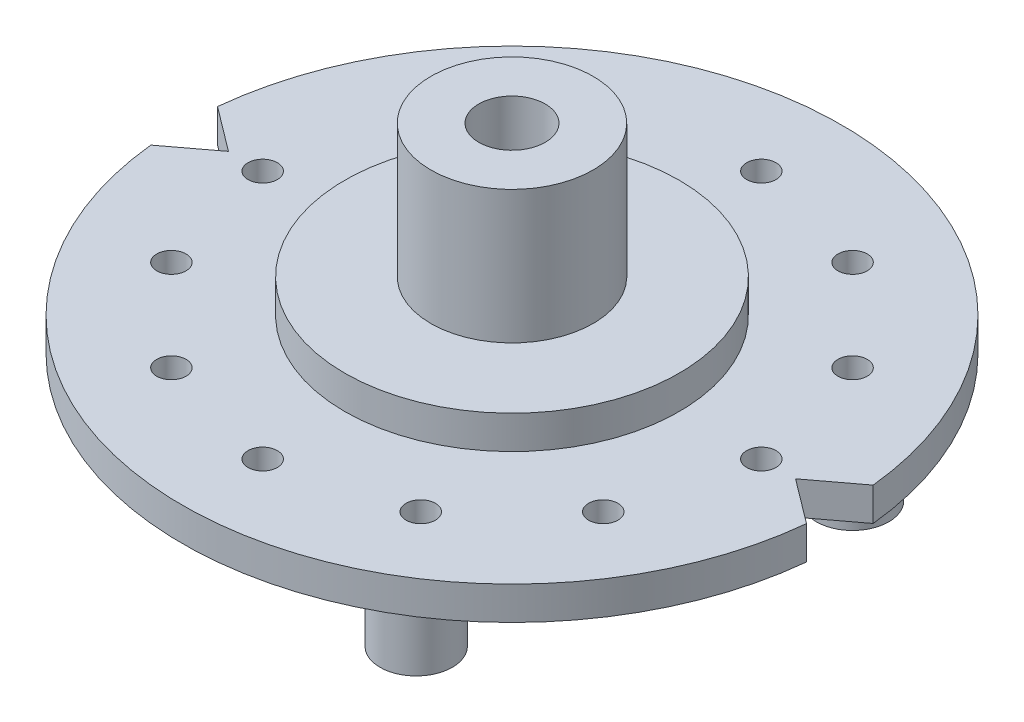
ISO-10303-21;
HEADER;
FILE_DESCRIPTION(('STEP AP214'),'2;1');
FILE_NAME('part.step','',(''),(''),'','','');
FILE_SCHEMA(('AUTOMOTIVE_DESIGN { 1 0 10303 214 1 1 1 1 }'));
ENDSEC;
DATA;
#1=APPLICATION_CONTEXT('core data for automotive mechanical design processes');
#2=APPLICATION_PROTOCOL_DEFINITION('international standard','automotive_design',2000,#1);
#3=PRODUCT_CONTEXT('',#1,'mechanical');
#4=PRODUCT('Part','Part','',(#3));
#5=PRODUCT_RELATED_PRODUCT_CATEGORY('part','',(#4));
#6=PRODUCT_DEFINITION_FORMATION('','',#4);
#7=PRODUCT_DEFINITION_CONTEXT('part definition',#1,'design');
#8=PRODUCT_DEFINITION('design','',#6,#7);
#9=PRODUCT_DEFINITION_SHAPE('','',#8);
#10=(LENGTH_UNIT() NAMED_UNIT(*) SI_UNIT(.MILLI.,.METRE.));
#11=(NAMED_UNIT(*) PLANE_ANGLE_UNIT() SI_UNIT($,.RADIAN.));
#12=(NAMED_UNIT(*) SI_UNIT($,.STERADIAN.) SOLID_ANGLE_UNIT());
#13=UNCERTAINTY_MEASURE_WITH_UNIT(LENGTH_MEASURE(1.E-05),#10,'distance_accuracy_value','');
#14=(GEOMETRIC_REPRESENTATION_CONTEXT(3) GLOBAL_UNCERTAINTY_ASSIGNED_CONTEXT((#13)) GLOBAL_UNIT_ASSIGNED_CONTEXT((#10,
#11,#12)) REPRESENTATION_CONTEXT('',''));
#15=CARTESIAN_POINT('',(0.,0.,0.));
#16=DIRECTION('',(0.,0.,1.));
#17=DIRECTION('',(1.,0.,0.));
#18=AXIS2_PLACEMENT_3D('',#15,#16,#17);
#19=CARTESIAN_POINT('',(-13.33913809263,4.318,-17.7016341307042));
#20=DIRECTION('',(0.601815023152049,0.,0.798635510047292));
#21=DIRECTION('',(0.798635510047292,0.,-0.601815023152049));
#22=AXIS2_PLACEMENT_3D('',#19,#20,#21);
#23=PLANE('',#22);
#24=DIRECTION('',(-0.798635510047292,0.,0.601815023152049));
#25=VECTOR('',#24,1.);
#26=CARTESIAN_POINT('',(-13.33913809263,0.,-17.7016341307042));
#27=LINE('',#26,#25);
#28=CARTESIAN_POINT('',(-36.83,0.,0.));
#29=VERTEX_POINT('',#28);
#30=CARTESIAN_POINT('',(-42.5791674941471,0.,4.33230844993388));
#31=VERTEX_POINT('',#30);
#32=EDGE_CURVE('E162',#29,#31,#27,.T.);
#33=ORIENTED_EDGE('',*,*,#32,.T.);
#34=DIRECTION('',(0.,-1.,0.));
#35=VECTOR('',#34,1.);
#36=CARTESIAN_POINT('',(-42.5791674941471,4.318,4.33230844993388));
#37=LINE('',#36,#35);
#38=CARTESIAN_POINT('',(-42.5791674941471,4.318,4.33230844993388));
#39=VERTEX_POINT('',#38);
#40=EDGE_CURVE('E182',#39,#31,#37,.T.);
#41=ORIENTED_EDGE('',*,*,#40,.F.);
#42=DIRECTION('',(-0.798635510047292,0.,0.601815023152049));
#43=VECTOR('',#42,1.);
#44=CARTESIAN_POINT('',(-13.33913809263,4.318,-17.7016341307042));
#45=LINE('',#44,#43);
#46=CARTESIAN_POINT('',(-36.83,4.318,0.));
#47=VERTEX_POINT('',#46);
#48=EDGE_CURVE('E382',#47,#39,#45,.T.);
#49=ORIENTED_EDGE('',*,*,#48,.F.);
#50=DIRECTION('',(0.,-1.,0.));
#51=VECTOR('',#50,1.);
#52=CARTESIAN_POINT('',(-36.83,4.318,0.));
#53=LINE('',#52,#51);
#54=EDGE_CURVE('E56',#47,#29,#53,.T.);
#55=ORIENTED_EDGE('',*,*,#54,.T.);
#56=EDGE_LOOP('',(#33,#41,#49,#55));
#57=FACE_BOUND('',#56,.T.);
#58=ADVANCED_FACE('F39',(#57),#23,.F.);
#59=CARTESIAN_POINT('',(0.,4.318,0.));
#60=DIRECTION('',(0.,-1.,0.));
#61=DIRECTION('',(0.,0.,-1.));
#62=AXIS2_PLACEMENT_3D('',#59,#60,#61);
#63=CYLINDRICAL_SURFACE('',#62,42.799);
#64=CARTESIAN_POINT('',(0.,0.,0.));
#65=DIRECTION('',(0.,1.,0.));
#66=DIRECTION('',(0.,0.,1.));
#67=AXIS2_PLACEMENT_3D('',#64,#65,#66);
#68=CIRCLE('',#67,42.799);
#69=CARTESIAN_POINT('',(42.5791674941471,0.,4.33230844993388));
#70=VERTEX_POINT('',#69);
#71=EDGE_CURVE('E164',#31,#70,#68,.T.);
#72=ORIENTED_EDGE('',*,*,#71,.T.);
#73=DIRECTION('',(0.,-1.,0.));
#74=VECTOR('',#73,1.);
#75=CARTESIAN_POINT('',(42.5791674941471,4.318,4.33230844993388));
#76=LINE('',#75,#74);
#77=CARTESIAN_POINT('',(42.5791674941471,4.318,4.33230844993388));
#78=VERTEX_POINT('',#77);
#79=EDGE_CURVE('E180',#78,#70,#76,.T.);
#80=ORIENTED_EDGE('',*,*,#79,.F.);
#81=CARTESIAN_POINT('',(0.,4.318,0.));
#82=DIRECTION('',(0.,1.,0.));
#83=DIRECTION('',(0.,0.,1.));
#84=AXIS2_PLACEMENT_3D('',#81,#82,#83);
#85=CIRCLE('',#84,42.799);
#86=EDGE_CURVE('E90',#39,#78,#85,.T.);
#87=ORIENTED_EDGE('',*,*,#86,.F.);
#88=ORIENTED_EDGE('',*,*,#40,.T.);
#89=EDGE_LOOP('',(#72,#80,#87,#88));
#90=FACE_BOUND('',#89,.T.);
#91=ADVANCED_FACE('F234',(#90),#63,.T.);
#92=CARTESIAN_POINT('',(13.33913809263,4.318,-17.7016341307042));
#93=DIRECTION('',(0.601815023152049,0.,-0.798635510047292));
#94=DIRECTION('',(-0.798635510047292,0.,-0.601815023152049));
#95=AXIS2_PLACEMENT_3D('',#92,#93,#94);
#96=PLANE('',#95);
#97=DIRECTION('',(0.798635510047292,0.,0.601815023152049));
#98=VECTOR('',#97,1.);
#99=CARTESIAN_POINT('',(13.33913809263,0.,-17.7016341307042));
#100=LINE('',#99,#98);
#101=CARTESIAN_POINT('',(36.83,0.,0.));
#102=VERTEX_POINT('',#101);
#103=EDGE_CURVE('E167',#102,#70,#100,.T.);
#104=ORIENTED_EDGE('',*,*,#103,.F.);
#105=DIRECTION('',(0.,-1.,0.));
#106=VECTOR('',#105,1.);
#107=CARTESIAN_POINT('',(36.83,4.318,0.));
#108=LINE('',#107,#106);
#109=CARTESIAN_POINT('',(36.83,4.318,0.));
#110=VERTEX_POINT('',#109);
#111=EDGE_CURVE('E117',#110,#102,#108,.T.);
#112=ORIENTED_EDGE('',*,*,#111,.F.);
#113=DIRECTION('',(0.798635510047292,0.,0.601815023152049));
#114=VECTOR('',#113,1.);
#115=CARTESIAN_POINT('',(13.33913809263,4.318,-17.7016341307042));
#116=LINE('',#115,#114);
#117=EDGE_CURVE('E107',#110,#78,#116,.T.);
#118=ORIENTED_EDGE('',*,*,#117,.T.);
#119=ORIENTED_EDGE('',*,*,#79,.T.);
#120=EDGE_LOOP('',(#104,#112,#118,#119));
#121=FACE_BOUND('',#120,.T.);
#122=ADVANCED_FACE('F239',(#121),#96,.T.);
#123=CARTESIAN_POINT('',(13.33913809263,4.318,17.7016341307042));
#124=DIRECTION('',(-0.601815023152049,0.,-0.798635510047292));
#125=DIRECTION('',(-0.798635510047292,0.,0.601815023152049));
#126=AXIS2_PLACEMENT_3D('',#123,#124,#125);
#127=PLANE('',#126);
#128=DIRECTION('',(0.798635510047292,0.,-0.601815023152049));
#129=VECTOR('',#128,1.);
#130=CARTESIAN_POINT('',(13.33913809263,0.,17.7016341307042));
#131=LINE('',#130,#129);
#132=CARTESIAN_POINT('',(42.5791674941471,0.,-4.33230844993388));
#133=VERTEX_POINT('',#132);
#134=EDGE_CURVE('E114',#102,#133,#131,.T.);
#135=ORIENTED_EDGE('',*,*,#134,.T.);
#136=DIRECTION('',(0.,-1.,0.));
#137=VECTOR('',#136,1.);
#138=CARTESIAN_POINT('',(42.5791674941471,4.318,-4.33230844993388));
#139=LINE('',#138,#137);
#140=CARTESIAN_POINT('',(42.5791674941471,4.318,-4.33230844993388));
#141=VERTEX_POINT('',#140);
#142=EDGE_CURVE('E111',#141,#133,#139,.T.);
#143=ORIENTED_EDGE('',*,*,#142,.F.);
#144=DIRECTION('',(0.798635510047292,0.,-0.601815023152049));
#145=VECTOR('',#144,1.);
#146=CARTESIAN_POINT('',(13.33913809263,4.318,17.7016341307042));
#147=LINE('',#146,#145);
#148=EDGE_CURVE('E100',#110,#141,#147,.T.);
#149=ORIENTED_EDGE('',*,*,#148,.F.);
#150=ORIENTED_EDGE('',*,*,#111,.T.);
#151=EDGE_LOOP('',(#135,#143,#149,#150));
#152=FACE_BOUND('',#151,.T.);
#153=ADVANCED_FACE('F112',(#152),#127,.F.);
#154=CARTESIAN_POINT('',(0.,4.318,0.));
#155=DIRECTION('',(0.,-1.,0.));
#156=DIRECTION('',(0.,0.,-1.));
#157=AXIS2_PLACEMENT_3D('',#154,#155,#156);
#158=CYLINDRICAL_SURFACE('',#157,42.799);
#159=CARTESIAN_POINT('',(0.,0.,0.));
#160=DIRECTION('',(0.,1.,0.));
#161=DIRECTION('',(0.,0.,1.));
#162=AXIS2_PLACEMENT_3D('',#159,#160,#161);
#163=CIRCLE('',#162,42.799);
#164=CARTESIAN_POINT('',(-42.5791674941471,0.,-4.33230844993388));
#165=VERTEX_POINT('',#164);
#166=EDGE_CURVE('E171',#133,#165,#163,.T.);
#167=ORIENTED_EDGE('',*,*,#166,.T.);
#168=DIRECTION('',(0.,-1.,0.));
#169=VECTOR('',#168,1.);
#170=CARTESIAN_POINT('',(-42.5791674941471,4.318,-4.33230844993388));
#171=LINE('',#170,#169);
#172=CARTESIAN_POINT('',(-42.5791674941471,4.318,-4.33230844993388));
#173=VERTEX_POINT('',#172);
#174=EDGE_CURVE('E77',#173,#165,#171,.T.);
#175=ORIENTED_EDGE('',*,*,#174,.F.);
#176=CARTESIAN_POINT('',(0.,4.318,0.));
#177=DIRECTION('',(0.,1.,0.));
#178=DIRECTION('',(0.,0.,1.));
#179=AXIS2_PLACEMENT_3D('',#176,#177,#178);
#180=CIRCLE('',#179,42.799);
#181=EDGE_CURVE('E105',#141,#173,#180,.T.);
#182=ORIENTED_EDGE('',*,*,#181,.F.);
#183=ORIENTED_EDGE('',*,*,#142,.T.);
#184=EDGE_LOOP('',(#167,#175,#182,#183));
#185=FACE_BOUND('',#184,.T.);
#186=ADVANCED_FACE('F119',(#185),#158,.T.);
#187=CARTESIAN_POINT('',(28.046232701559,4.318,16.1925));
#188=DIRECTION('',(0.,-1.,0.));
#189=DIRECTION('',(0.,0.,-1.));
#190=AXIS2_PLACEMENT_3D('',#187,#188,#189);
#191=CYLINDRICAL_SURFACE('',#190,1.905);
#192=CARTESIAN_POINT('',(28.046232701559,4.318,16.1925));
#193=DIRECTION('',(0.,1.,0.));
#194=DIRECTION('',(0.,0.,1.));
#195=AXIS2_PLACEMENT_3D('',#192,#193,#194);
#196=CIRCLE('',#195,1.905);
#197=CARTESIAN_POINT('',(28.046232701559,4.318,18.0975));
#198=VERTEX_POINT('',#197);
#199=EDGE_CURVE('E378',#198,#198,#196,.T.);
#200=ORIENTED_EDGE('',*,*,#199,.T.);
#201=EDGE_LOOP('',(#200));
#202=FACE_BOUND('',#201,.T.);
#203=CARTESIAN_POINT('',(28.046232701559,0.,16.1925));
#204=DIRECTION('',(0.,1.,0.));
#205=DIRECTION('',(0.,0.,1.));
#206=AXIS2_PLACEMENT_3D('',#203,#204,#205);
#207=CIRCLE('',#206,1.905);
#208=CARTESIAN_POINT('',(28.046232701559,0.,18.0975));
#209=VERTEX_POINT('',#208);
#210=EDGE_CURVE('E159',#209,#209,#207,.T.);
#211=ORIENTED_EDGE('',*,*,#210,.F.);
#212=EDGE_LOOP('',(#211));
#213=FACE_BOUND('',#212,.T.);
#214=ADVANCED_FACE('F243',(#202,#213),#191,.F.);
#215=CARTESIAN_POINT('',(16.1924999999999,4.318,28.0462327015591));
#216=DIRECTION('',(0.,-1.,0.));
#217=DIRECTION('',(0.,0.,-1.));
#218=AXIS2_PLACEMENT_3D('',#215,#216,#217);
#219=CYLINDRICAL_SURFACE('',#218,1.905);
#220=CARTESIAN_POINT('',(16.1924999999999,4.318,28.0462327015591));
#221=DIRECTION('',(0.,1.,0.));
#222=DIRECTION('',(0.,0.,1.));
#223=AXIS2_PLACEMENT_3D('',#220,#221,#222);
#224=CIRCLE('',#223,1.905);
#225=CARTESIAN_POINT('',(16.1924999999999,4.318,29.9512327015591));
#226=VERTEX_POINT('',#225);
#227=EDGE_CURVE('E375',#226,#226,#224,.T.);
#228=ORIENTED_EDGE('',*,*,#227,.T.);
#229=EDGE_LOOP('',(#228));
#230=FACE_BOUND('',#229,.T.);
#231=CARTESIAN_POINT('',(16.1924999999999,0.,28.0462327015591));
#232=DIRECTION('',(0.,1.,0.));
#233=DIRECTION('',(0.,0.,1.));
#234=AXIS2_PLACEMENT_3D('',#231,#232,#233);
#235=CIRCLE('',#234,1.905);
#236=CARTESIAN_POINT('',(16.1924999999999,0.,29.9512327015591));
#237=VERTEX_POINT('',#236);
#238=EDGE_CURVE('E156',#237,#237,#235,.T.);
#239=ORIENTED_EDGE('',*,*,#238,.F.);
#240=EDGE_LOOP('',(#239));
#241=FACE_BOUND('',#240,.T.);
#242=ADVANCED_FACE('F246',(#230,#241),#219,.F.);
#243=CARTESIAN_POINT('',(-1.07552855510562E-13,4.318,32.385));
#244=DIRECTION('',(0.,-1.,0.));
#245=DIRECTION('',(0.,0.,-1.));
#246=AXIS2_PLACEMENT_3D('',#243,#244,#245);
#247=CYLINDRICAL_SURFACE('',#246,1.90500000000001);
#248=CARTESIAN_POINT('',(-1.07552855510562E-13,4.318,32.385));
#249=DIRECTION('',(0.,1.,0.));
#250=DIRECTION('',(0.,0.,1.));
#251=AXIS2_PLACEMENT_3D('',#248,#249,#250);
#252=CIRCLE('',#251,1.90500000000001);
#253=CARTESIAN_POINT('',(-1.07552855510562E-13,4.318,34.29));
#254=VERTEX_POINT('',#253);
#255=EDGE_CURVE('E372',#254,#254,#252,.T.);
#256=ORIENTED_EDGE('',*,*,#255,.T.);
#257=EDGE_LOOP('',(#256));
#258=FACE_BOUND('',#257,.T.);
#259=CARTESIAN_POINT('',(-1.07552855510562E-13,0.,32.385));
#260=DIRECTION('',(0.,1.,0.));
#261=DIRECTION('',(0.,0.,1.));
#262=AXIS2_PLACEMENT_3D('',#259,#260,#261);
#263=CIRCLE('',#262,1.90500000000001);
#264=CARTESIAN_POINT('',(-1.07552855510562E-13,0.,34.29));
#265=VERTEX_POINT('',#264);
#266=EDGE_CURVE('E153',#265,#265,#263,.T.);
#267=ORIENTED_EDGE('',*,*,#266,.F.);
#268=EDGE_LOOP('',(#267));
#269=FACE_BOUND('',#268,.T.);
#270=ADVANCED_FACE('F250',(#258,#269),#247,.F.);
#271=CARTESIAN_POINT('',(-16.1925000000001,4.318,28.046232701559));
#272=DIRECTION('',(0.,-1.,0.));
#273=DIRECTION('',(0.,0.,-1.));
#274=AXIS2_PLACEMENT_3D('',#271,#272,#273);
#275=CYLINDRICAL_SURFACE('',#274,1.905);
#276=CARTESIAN_POINT('',(-16.1925000000001,4.318,28.046232701559));
#277=DIRECTION('',(0.,1.,0.));
#278=DIRECTION('',(0.,0.,1.));
#279=AXIS2_PLACEMENT_3D('',#276,#277,#278);
#280=CIRCLE('',#279,1.905);
#281=CARTESIAN_POINT('',(-16.1925000000001,4.318,29.951232701559));
#282=VERTEX_POINT('',#281);
#283=EDGE_CURVE('E369',#282,#282,#280,.T.);
#284=ORIENTED_EDGE('',*,*,#283,.T.);
#285=EDGE_LOOP('',(#284));
#286=FACE_BOUND('',#285,.T.);
#287=CARTESIAN_POINT('',(-16.1925000000001,0.,28.046232701559));
#288=DIRECTION('',(0.,1.,0.));
#289=DIRECTION('',(0.,0.,1.));
#290=AXIS2_PLACEMENT_3D('',#287,#288,#289);
#291=CIRCLE('',#290,1.905);
#292=CARTESIAN_POINT('',(-16.1925000000001,0.,29.951232701559));
#293=VERTEX_POINT('',#292);
#294=EDGE_CURVE('E150',#293,#293,#291,.T.);
#295=ORIENTED_EDGE('',*,*,#294,.F.);
#296=EDGE_LOOP('',(#295));
#297=FACE_BOUND('',#296,.T.);
#298=ADVANCED_FACE('F254',(#286,#297),#275,.F.);
#299=CARTESIAN_POINT('',(-28.0462327015591,4.318,16.1924999999998));
#300=DIRECTION('',(0.,-1.,0.));
#301=DIRECTION('',(0.,0.,-1.));
#302=AXIS2_PLACEMENT_3D('',#299,#300,#301);
#303=CYLINDRICAL_SURFACE('',#302,1.905);
#304=CARTESIAN_POINT('',(-28.0462327015591,4.318,16.1924999999998));
#305=DIRECTION('',(0.,1.,0.));
#306=DIRECTION('',(0.,0.,1.));
#307=AXIS2_PLACEMENT_3D('',#304,#305,#306);
#308=CIRCLE('',#307,1.905);
#309=CARTESIAN_POINT('',(-28.0462327015591,4.318,18.0974999999998));
#310=VERTEX_POINT('',#309);
#311=EDGE_CURVE('E366',#310,#310,#308,.T.);
#312=ORIENTED_EDGE('',*,*,#311,.T.);
#313=EDGE_LOOP('',(#312));
#314=FACE_BOUND('',#313,.T.);
#315=CARTESIAN_POINT('',(-28.0462327015591,0.,16.1924999999998));
#316=DIRECTION('',(0.,1.,0.));
#317=DIRECTION('',(0.,0.,1.));
#318=AXIS2_PLACEMENT_3D('',#315,#316,#317);
#319=CIRCLE('',#318,1.905);
#320=CARTESIAN_POINT('',(-28.0462327015591,0.,18.0974999999998));
#321=VERTEX_POINT('',#320);
#322=EDGE_CURVE('E147',#321,#321,#319,.T.);
#323=ORIENTED_EDGE('',*,*,#322,.F.);
#324=EDGE_LOOP('',(#323));
#325=FACE_BOUND('',#324,.T.);
#326=ADVANCED_FACE('F258',(#314,#325),#303,.F.);
#327=CARTESIAN_POINT('',(-32.385,4.318,-2.34187669256869E-13));
#328=DIRECTION('',(0.,-1.,0.));
#329=DIRECTION('',(0.,0.,-1.));
#330=AXIS2_PLACEMENT_3D('',#327,#328,#329);
#331=CYLINDRICAL_SURFACE('',#330,1.905);
#332=CARTESIAN_POINT('',(-32.385,4.318,-2.34187669256869E-13));
#333=DIRECTION('',(0.,1.,0.));
#334=DIRECTION('',(0.,0.,1.));
#335=AXIS2_PLACEMENT_3D('',#332,#333,#334);
#336=CIRCLE('',#335,1.905);
#337=CARTESIAN_POINT('',(-32.385,4.318,1.90499999999976));
#338=VERTEX_POINT('',#337);
#339=EDGE_CURVE('E363',#338,#338,#336,.T.);
#340=ORIENTED_EDGE('',*,*,#339,.T.);
#341=EDGE_LOOP('',(#340));
#342=FACE_BOUND('',#341,.T.);
#343=CARTESIAN_POINT('',(-32.385,0.,-2.34187669256869E-13));
#344=DIRECTION('',(0.,1.,0.));
#345=DIRECTION('',(0.,0.,1.));
#346=AXIS2_PLACEMENT_3D('',#343,#344,#345);
#347=CIRCLE('',#346,1.905);
#348=CARTESIAN_POINT('',(-32.385,0.,1.90499999999976));
#349=VERTEX_POINT('',#348);
#350=EDGE_CURVE('E144',#349,#349,#347,.T.);
#351=ORIENTED_EDGE('',*,*,#350,.F.);
#352=EDGE_LOOP('',(#351));
#353=FACE_BOUND('',#352,.T.);
#354=ADVANCED_FACE('F262',(#342,#353),#331,.F.);
#355=CARTESIAN_POINT('',(-28.0462327015589,4.318,-16.1925000000002));
#356=DIRECTION('',(0.,-1.,0.));
#357=DIRECTION('',(0.,0.,-1.));
#358=AXIS2_PLACEMENT_3D('',#355,#356,#357);
#359=CYLINDRICAL_SURFACE('',#358,1.905);
#360=CARTESIAN_POINT('',(-28.0462327015589,4.318,-16.1925000000002));
#361=DIRECTION('',(0.,1.,0.));
#362=DIRECTION('',(0.,0.,1.));
#363=AXIS2_PLACEMENT_3D('',#360,#361,#362);
#364=CIRCLE('',#363,1.905);
#365=CARTESIAN_POINT('',(-28.0462327015589,4.318,-14.2875000000002));
#366=VERTEX_POINT('',#365);
#367=EDGE_CURVE('E360',#366,#366,#364,.T.);
#368=ORIENTED_EDGE('',*,*,#367,.T.);
#369=EDGE_LOOP('',(#368));
#370=FACE_BOUND('',#369,.T.);
#371=CARTESIAN_POINT('',(-28.0462327015589,0.,-16.1925000000002));
#372=DIRECTION('',(0.,1.,0.));
#373=DIRECTION('',(0.,0.,1.));
#374=AXIS2_PLACEMENT_3D('',#371,#372,#373);
#375=CIRCLE('',#374,1.905);
#376=CARTESIAN_POINT('',(-28.0462327015589,0.,-14.2875000000002));
#377=VERTEX_POINT('',#376);
#378=EDGE_CURVE('E141',#377,#377,#375,.T.);
#379=ORIENTED_EDGE('',*,*,#378,.F.);
#380=EDGE_LOOP('',(#379));
#381=FACE_BOUND('',#380,.T.);
#382=ADVANCED_FACE('F266',(#370,#381),#359,.F.);
#383=CARTESIAN_POINT('',(-16.1924999999997,4.318,-28.0462327015592));
#384=DIRECTION('',(0.,-1.,0.));
#385=DIRECTION('',(0.,0.,-1.));
#386=AXIS2_PLACEMENT_3D('',#383,#384,#385);
#387=CYLINDRICAL_SURFACE('',#386,1.905);
#388=CARTESIAN_POINT('',(-16.1924999999997,4.318,-28.0462327015592));
#389=DIRECTION('',(0.,1.,0.));
#390=DIRECTION('',(0.,0.,1.));
#391=AXIS2_PLACEMENT_3D('',#388,#389,#390);
#392=CIRCLE('',#391,1.905);
#393=CARTESIAN_POINT('',(-16.1924999999997,4.318,-26.1412327015592));
#394=VERTEX_POINT('',#393);
#395=EDGE_CURVE('E357',#394,#394,#392,.T.);
#396=ORIENTED_EDGE('',*,*,#395,.T.);
#397=EDGE_LOOP('',(#396));
#398=FACE_BOUND('',#397,.T.);
#399=CARTESIAN_POINT('',(-16.1924999999997,0.,-28.0462327015592));
#400=DIRECTION('',(0.,1.,0.));
#401=DIRECTION('',(0.,0.,1.));
#402=AXIS2_PLACEMENT_3D('',#399,#400,#401);
#403=CIRCLE('',#402,1.905);
#404=CARTESIAN_POINT('',(-16.1924999999997,0.,-26.1412327015592));
#405=VERTEX_POINT('',#404);
#406=EDGE_CURVE('E138',#405,#405,#403,.T.);
#407=ORIENTED_EDGE('',*,*,#406,.F.);
#408=EDGE_LOOP('',(#407));
#409=FACE_BOUND('',#408,.T.);
#410=ADVANCED_FACE('F270',(#398,#409),#387,.F.);
#411=CARTESIAN_POINT('',(3.36536354339501E-13,4.318,-32.385));
#412=DIRECTION('',(0.,-1.,0.));
#413=DIRECTION('',(0.,0.,-1.));
#414=AXIS2_PLACEMENT_3D('',#411,#412,#413);
#415=CYLINDRICAL_SURFACE('',#414,1.905);
#416=CARTESIAN_POINT('',(3.36536354339501E-13,4.318,-32.385));
#417=DIRECTION('',(0.,1.,0.));
#418=DIRECTION('',(0.,0.,1.));
#419=AXIS2_PLACEMENT_3D('',#416,#417,#418);
#420=CIRCLE('',#419,1.905);
#421=CARTESIAN_POINT('',(3.36536354339501E-13,4.318,-30.48));
#422=VERTEX_POINT('',#421);
#423=EDGE_CURVE('E354',#422,#422,#420,.T.);
#424=ORIENTED_EDGE('',*,*,#423,.T.);
#425=EDGE_LOOP('',(#424));
#426=FACE_BOUND('',#425,.T.);
#427=CARTESIAN_POINT('',(3.36536354339501E-13,0.,-32.385));
#428=DIRECTION('',(0.,1.,0.));
#429=DIRECTION('',(0.,0.,1.));
#430=AXIS2_PLACEMENT_3D('',#427,#428,#429);
#431=CIRCLE('',#430,1.905);
#432=CARTESIAN_POINT('',(3.36536354339501E-13,0.,-30.48));
#433=VERTEX_POINT('',#432);
#434=EDGE_CURVE('E135',#433,#433,#431,.T.);
#435=ORIENTED_EDGE('',*,*,#434,.F.);
#436=EDGE_LOOP('',(#435));
#437=FACE_BOUND('',#436,.T.);
#438=ADVANCED_FACE('F274',(#426,#437),#415,.F.);
#439=CARTESIAN_POINT('',(16.1925000000003,4.318,-28.0462327015588));
#440=DIRECTION('',(0.,-1.,0.));
#441=DIRECTION('',(0.,0.,-1.));
#442=AXIS2_PLACEMENT_3D('',#439,#440,#441);
#443=CYLINDRICAL_SURFACE('',#442,1.905);
#444=CARTESIAN_POINT('',(16.1925000000003,4.318,-28.0462327015588));
#445=DIRECTION('',(0.,1.,0.));
#446=DIRECTION('',(0.,0.,1.));
#447=AXIS2_PLACEMENT_3D('',#444,#445,#446);
#448=CIRCLE('',#447,1.905);
#449=CARTESIAN_POINT('',(16.1925000000003,4.318,-26.1412327015588));
#450=VERTEX_POINT('',#449);
#451=EDGE_CURVE('E351',#450,#450,#448,.T.);
#452=ORIENTED_EDGE('',*,*,#451,.T.);
#453=EDGE_LOOP('',(#452));
#454=FACE_BOUND('',#453,.T.);
#455=CARTESIAN_POINT('',(16.1925000000003,0.,-28.0462327015588));
#456=DIRECTION('',(0.,1.,0.));
#457=DIRECTION('',(0.,0.,1.));
#458=AXIS2_PLACEMENT_3D('',#455,#456,#457);
#459=CIRCLE('',#458,1.905);
#460=CARTESIAN_POINT('',(16.1925000000003,0.,-26.1412327015588));
#461=VERTEX_POINT('',#460);
#462=EDGE_CURVE('E132',#461,#461,#459,.T.);
#463=ORIENTED_EDGE('',*,*,#462,.F.);
#464=EDGE_LOOP('',(#463));
#465=FACE_BOUND('',#464,.T.);
#466=ADVANCED_FACE('F278',(#454,#465),#443,.F.);
#467=CARTESIAN_POINT('',(28.046232701559,4.318,-16.1925));
#468=DIRECTION('',(0.,-1.,0.));
#469=DIRECTION('',(0.,0.,-1.));
#470=AXIS2_PLACEMENT_3D('',#467,#468,#469);
#471=CYLINDRICAL_SURFACE('',#470,1.90499999999971);
#472=CARTESIAN_POINT('',(28.046232701559,4.318,-16.1925));
#473=DIRECTION('',(0.,1.,0.));
#474=DIRECTION('',(0.,0.,1.));
#475=AXIS2_PLACEMENT_3D('',#472,#473,#474);
#476=CIRCLE('',#475,1.90499999999971);
#477=CARTESIAN_POINT('',(28.046232701559,4.318,-14.2875000000003));
#478=VERTEX_POINT('',#477);
#479=EDGE_CURVE('E289',#478,#478,#476,.T.);
#480=ORIENTED_EDGE('',*,*,#479,.T.);
#481=EDGE_LOOP('',(#480));
#482=FACE_BOUND('',#481,.T.);
#483=CARTESIAN_POINT('',(28.046232701559,0.,-16.1925));
#484=DIRECTION('',(0.,1.,0.));
#485=DIRECTION('',(0.,0.,1.));
#486=AXIS2_PLACEMENT_3D('',#483,#484,#485);
#487=CIRCLE('',#486,1.90499999999971);
#488=CARTESIAN_POINT('',(28.046232701559,0.,-14.2875000000003));
#489=VERTEX_POINT('',#488);
#490=EDGE_CURVE('E128',#489,#489,#487,.T.);
#491=ORIENTED_EDGE('',*,*,#490,.F.);
#492=EDGE_LOOP('',(#491));
#493=FACE_BOUND('',#492,.T.);
#494=ADVANCED_FACE('F230',(#482,#493),#471,.F.);
#495=CARTESIAN_POINT('',(32.385,4.318,4.47558656802016E-13));
#496=DIRECTION('',(0.,-1.,0.));
#497=DIRECTION('',(0.,0.,-1.));
#498=AXIS2_PLACEMENT_3D('',#495,#496,#497);
#499=CYLINDRICAL_SURFACE('',#498,1.905);
#500=CARTESIAN_POINT('',(32.385,4.318,4.47558656802016E-13));
#501=DIRECTION('',(0.,1.,0.));
#502=DIRECTION('',(0.,0.,1.));
#503=AXIS2_PLACEMENT_3D('',#500,#501,#502);
#504=CIRCLE('',#503,1.905);
#505=CARTESIAN_POINT('',(32.385,4.318,1.90500000000045));
#506=VERTEX_POINT('',#505);
#507=EDGE_CURVE('E176',#506,#506,#504,.T.);
#508=ORIENTED_EDGE('',*,*,#507,.T.);
#509=EDGE_LOOP('',(#508));
#510=FACE_BOUND('',#509,.T.);
#511=CARTESIAN_POINT('',(32.385,0.,4.47558656802016E-13));
#512=DIRECTION('',(0.,1.,0.));
#513=DIRECTION('',(0.,0.,1.));
#514=AXIS2_PLACEMENT_3D('',#511,#512,#513);
#515=CIRCLE('',#514,1.905);
#516=CARTESIAN_POINT('',(32.385,0.,1.90500000000045));
#517=VERTEX_POINT('',#516);
#518=EDGE_CURVE('E125',#517,#517,#515,.T.);
#519=ORIENTED_EDGE('',*,*,#518,.F.);
#520=EDGE_LOOP('',(#519));
#521=FACE_BOUND('',#520,.T.);
#522=ADVANCED_FACE('F41',(#510,#521),#499,.F.);
#523=CARTESIAN_POINT('',(-13.33913809263,4.318,17.7016341307042));
#524=DIRECTION('',(-0.601815023152049,0.,0.798635510047292));
#525=DIRECTION('',(0.798635510047292,0.,0.601815023152049));
#526=AXIS2_PLACEMENT_3D('',#523,#524,#525);
#527=PLANE('',#526);
#528=DIRECTION('',(-0.798635510047292,0.,-0.601815023152049));
#529=VECTOR('',#528,1.);
#530=CARTESIAN_POINT('',(-13.33913809263,0.,17.7016341307042));
#531=LINE('',#530,#529);
#532=EDGE_CURVE('E173',#29,#165,#531,.T.);
#533=ORIENTED_EDGE('',*,*,#532,.F.);
#534=ORIENTED_EDGE('',*,*,#54,.F.);
#535=DIRECTION('',(-0.798635510047292,0.,-0.601815023152049));
#536=VECTOR('',#535,1.);
#537=CARTESIAN_POINT('',(-13.33913809263,4.318,17.7016341307042));
#538=LINE('',#537,#536);
#539=EDGE_CURVE('E120',#47,#173,#538,.T.);
#540=ORIENTED_EDGE('',*,*,#539,.T.);
#541=ORIENTED_EDGE('',*,*,#174,.T.);
#542=EDGE_LOOP('',(#533,#534,#540,#541));
#543=FACE_BOUND('',#542,.T.);
#544=ADVANCED_FACE('F221',(#543),#527,.T.);
#545=CARTESIAN_POINT('',(0.,4.318,0.));
#546=DIRECTION('',(0.,1.,0.));
#547=DIRECTION('',(0.,0.,1.));
#548=AXIS2_PLACEMENT_3D('',#545,#546,#547);
#549=PLANE('',#548);
#550=ORIENTED_EDGE('',*,*,#507,.F.);
#551=EDGE_LOOP('',(#550));
#552=FACE_BOUND('',#551,.T.);
#553=ORIENTED_EDGE('',*,*,#479,.F.);
#554=EDGE_LOOP('',(#553));
#555=FACE_BOUND('',#554,.T.);
#556=ORIENTED_EDGE('',*,*,#451,.F.);
#557=EDGE_LOOP('',(#556));
#558=FACE_BOUND('',#557,.T.);
#559=ORIENTED_EDGE('',*,*,#423,.F.);
#560=EDGE_LOOP('',(#559));
#561=FACE_BOUND('',#560,.T.);
#562=ORIENTED_EDGE('',*,*,#395,.F.);
#563=EDGE_LOOP('',(#562));
#564=FACE_BOUND('',#563,.T.);
#565=ORIENTED_EDGE('',*,*,#367,.F.);
#566=EDGE_LOOP('',(#565));
#567=FACE_BOUND('',#566,.T.);
#568=ORIENTED_EDGE('',*,*,#339,.F.);
#569=EDGE_LOOP('',(#568));
#570=FACE_BOUND('',#569,.T.);
#571=ORIENTED_EDGE('',*,*,#311,.F.);
#572=EDGE_LOOP('',(#571));
#573=FACE_BOUND('',#572,.T.);
#574=ORIENTED_EDGE('',*,*,#283,.F.);
#575=EDGE_LOOP('',(#574));
#576=FACE_BOUND('',#575,.T.);
#577=ORIENTED_EDGE('',*,*,#255,.F.);
#578=EDGE_LOOP('',(#577));
#579=FACE_BOUND('',#578,.T.);
#580=ORIENTED_EDGE('',*,*,#227,.F.);
#581=EDGE_LOOP('',(#580));
#582=FACE_BOUND('',#581,.T.);
#583=ORIENTED_EDGE('',*,*,#199,.F.);
#584=EDGE_LOOP('',(#583));
#585=FACE_BOUND('',#584,.T.);
#586=CARTESIAN_POINT('',(0.,4.318,0.));
#587=DIRECTION('',(0.,1.,0.));
#588=DIRECTION('',(0.,0.,1.));
#589=AXIS2_PLACEMENT_3D('',#586,#587,#588);
#590=CIRCLE('',#589,21.717);
#591=CARTESIAN_POINT('',(0.,4.318,21.717));
#592=VERTEX_POINT('',#591);
#593=EDGE_CURVE('E337',#592,#592,#590,.T.);
#594=ORIENTED_EDGE('',*,*,#593,.F.);
#595=EDGE_LOOP('',(#594));
#596=FACE_BOUND('',#595,.T.);
#597=ORIENTED_EDGE('',*,*,#48,.T.);
#598=ORIENTED_EDGE('',*,*,#86,.T.);
#599=ORIENTED_EDGE('',*,*,#117,.F.);
#600=ORIENTED_EDGE('',*,*,#148,.T.);
#601=ORIENTED_EDGE('',*,*,#181,.T.);
#602=ORIENTED_EDGE('',*,*,#539,.F.);
#603=EDGE_LOOP('',(#597,#598,#599,#600,#601,#602));
#604=FACE_BOUND('',#603,.T.);
#605=ADVANCED_FACE('F102',(#552,#555,#558,#561,#564,#567,#570,#573,#576,#579,#582,#585,#596,
#604),#549,.T.);
#606=CARTESIAN_POINT('',(0.,0.,0.));
#607=DIRECTION('',(0.,1.,0.));
#608=DIRECTION('',(0.,0.,1.));
#609=AXIS2_PLACEMENT_3D('',#606,#607,#608);
#610=PLANE('',#609);
#611=CARTESIAN_POINT('',(-16.6581205108475,0.,-28.1709953414202));
#612=DIRECTION('',(0.,1.,0.));
#613=DIRECTION('',(0.,0.,1.));
#614=AXIS2_PLACEMENT_3D('',#611,#612,#613);
#615=CIRCLE('',#614,4.699);
#616=CARTESIAN_POINT('',(-16.6581205108475,0.,-23.4719953414202));
#617=VERTEX_POINT('',#616);
#618=EDGE_CURVE('E11',#617,#617,#615,.F.);
#619=ORIENTED_EDGE('',*,*,#618,.F.);
#620=EDGE_LOOP('',(#619));
#621=FACE_BOUND('',#620,.T.);
#622=CARTESIAN_POINT('',(-28.6366158522678,0.,16.5333578709868));
#623=DIRECTION('',(0.,1.,0.));
#624=DIRECTION('',(0.,0.,1.));
#625=AXIS2_PLACEMENT_3D('',#622,#623,#624);
#626=CIRCLE('',#625,4.699);
#627=CARTESIAN_POINT('',(-28.6366158522678,0.,21.2323578709868));
#628=VERTEX_POINT('',#627);
#629=EDGE_CURVE('E48',#628,#628,#626,.F.);
#630=ORIENTED_EDGE('',*,*,#629,.F.);
#631=EDGE_LOOP('',(#630));
#632=FACE_BOUND('',#631,.T.);
#633=CARTESIAN_POINT('',(16.0677373601389,0.,28.5118532124068));
#634=DIRECTION('',(0.,1.,0.));
#635=DIRECTION('',(0.,0.,1.));
#636=AXIS2_PLACEMENT_3D('',#633,#634,#635);
#637=CIRCLE('',#636,4.699);
#638=CARTESIAN_POINT('',(16.0677373601389,0.,33.2108532124068));
#639=VERTEX_POINT('',#638);
#640=EDGE_CURVE('E187',#639,#639,#637,.F.);
#641=ORIENTED_EDGE('',*,*,#640,.F.);
#642=EDGE_LOOP('',(#641));
#643=FACE_BOUND('',#642,.T.);
#644=CARTESIAN_POINT('',(28.046232701559,0.,-16.1925));
#645=DIRECTION('',(0.,1.,0.));
#646=DIRECTION('',(0.,0.,1.));
#647=AXIS2_PLACEMENT_3D('',#644,#645,#646);
#648=CIRCLE('',#647,4.699);
#649=CARTESIAN_POINT('',(28.046232701559,0.,-11.4935));
#650=VERTEX_POINT('',#649);
#651=EDGE_CURVE('E184',#650,#650,#648,.F.);
#652=ORIENTED_EDGE('',*,*,#651,.F.);
#653=EDGE_LOOP('',(#652));
#654=FACE_BOUND('',#653,.T.);
#655=ORIENTED_EDGE('',*,*,#518,.T.);
#656=EDGE_LOOP('',(#655));
#657=FACE_BOUND('',#656,.T.);
#658=ORIENTED_EDGE('',*,*,#462,.T.);
#659=EDGE_LOOP('',(#658));
#660=FACE_BOUND('',#659,.T.);
#661=ORIENTED_EDGE('',*,*,#434,.T.);
#662=EDGE_LOOP('',(#661));
#663=FACE_BOUND('',#662,.T.);
#664=ORIENTED_EDGE('',*,*,#378,.T.);
#665=EDGE_LOOP('',(#664));
#666=FACE_BOUND('',#665,.T.);
#667=ORIENTED_EDGE('',*,*,#350,.T.);
#668=EDGE_LOOP('',(#667));
#669=FACE_BOUND('',#668,.T.);
#670=ORIENTED_EDGE('',*,*,#294,.T.);
#671=EDGE_LOOP('',(#670));
#672=FACE_BOUND('',#671,.T.);
#673=ORIENTED_EDGE('',*,*,#266,.T.);
#674=EDGE_LOOP('',(#673));
#675=FACE_BOUND('',#674,.T.);
#676=ORIENTED_EDGE('',*,*,#210,.T.);
#677=EDGE_LOOP('',(#676));
#678=FACE_BOUND('',#677,.T.);
#679=ORIENTED_EDGE('',*,*,#32,.F.);
#680=ORIENTED_EDGE('',*,*,#532,.T.);
#681=ORIENTED_EDGE('',*,*,#166,.F.);
#682=ORIENTED_EDGE('',*,*,#134,.F.);
#683=ORIENTED_EDGE('',*,*,#103,.T.);
#684=ORIENTED_EDGE('',*,*,#71,.F.);
#685=EDGE_LOOP('',(#679,#680,#681,#682,#683,#684));
#686=FACE_BOUND('',#685,.T.);
#687=ADVANCED_FACE('F194',(#621,#632,#643,#654,#657,#660,#663,#666,#669,#672,#675,#678,#686),
#610,.F.);
#688=CARTESIAN_POINT('',(0.,8.636,0.));
#689=DIRECTION('',(0.,-1.,0.));
#690=DIRECTION('',(0.,0.,-1.));
#691=AXIS2_PLACEMENT_3D('',#688,#689,#690);
#692=CYLINDRICAL_SURFACE('',#691,21.717);
#693=ORIENTED_EDGE('',*,*,#593,.T.);
#694=EDGE_LOOP('',(#693));
#695=FACE_BOUND('',#694,.T.);
#696=CARTESIAN_POINT('',(0.,8.636,0.));
#697=DIRECTION('',(0.,1.,0.));
#698=DIRECTION('',(0.,0.,1.));
#699=AXIS2_PLACEMENT_3D('',#696,#697,#698);
#700=CIRCLE('',#699,21.717);
#701=CARTESIAN_POINT('',(0.,8.636,21.717));
#702=VERTEX_POINT('',#701);
#703=EDGE_CURVE('E129',#702,#702,#700,.T.);
#704=ORIENTED_EDGE('',*,*,#703,.F.);
#705=EDGE_LOOP('',(#704));
#706=FACE_BOUND('',#705,.T.);
#707=ADVANCED_FACE('F197',(#695,#706),#692,.T.);
#708=CARTESIAN_POINT('',(0.,8.636,0.));
#709=DIRECTION('',(0.,1.,0.));
#710=DIRECTION('',(0.,0.,1.));
#711=AXIS2_PLACEMENT_3D('',#708,#709,#710);
#712=PLANE('',#711);
#713=CARTESIAN_POINT('',(0.,8.636,0.));
#714=DIRECTION('',(0.,1.,0.));
#715=DIRECTION('',(0.,0.,1.));
#716=AXIS2_PLACEMENT_3D('',#713,#714,#715);
#717=CIRCLE('',#716,10.541);
#718=CARTESIAN_POINT('',(0.,8.636,10.541));
#719=VERTEX_POINT('',#718);
#720=EDGE_CURVE('E341',#719,#719,#717,.T.);
#721=ORIENTED_EDGE('',*,*,#720,.F.);
#722=EDGE_LOOP('',(#721));
#723=FACE_BOUND('',#722,.T.);
#724=ORIENTED_EDGE('',*,*,#703,.T.);
#725=EDGE_LOOP('',(#724));
#726=FACE_BOUND('',#725,.T.);
#727=ADVANCED_FACE('F322',(#723,#726),#712,.T.);
#728=CARTESIAN_POINT('',(0.,25.908,0.));
#729=DIRECTION('',(0.,1.,0.));
#730=DIRECTION('',(0.,0.,1.));
#731=AXIS2_PLACEMENT_3D('',#728,#729,#730);
#732=PLANE('',#731);
#733=CARTESIAN_POINT('',(0.,25.908,0.));
#734=DIRECTION('',(0.,1.,0.));
#735=DIRECTION('',(0.,0.,1.));
#736=AXIS2_PLACEMENT_3D('',#733,#734,#735);
#737=CIRCLE('',#736,4.31800000000001);
#738=CARTESIAN_POINT('',(0.,25.908,4.31800000000001));
#739=VERTEX_POINT('',#738);
#740=EDGE_CURVE('E621',#739,#739,#737,.T.);
#741=ORIENTED_EDGE('',*,*,#740,.F.);
#742=EDGE_LOOP('',(#741));
#743=FACE_BOUND('',#742,.T.);
#744=CARTESIAN_POINT('',(0.,25.908,0.));
#745=DIRECTION('',(0.,1.,0.));
#746=DIRECTION('',(0.,0.,1.));
#747=AXIS2_PLACEMENT_3D('',#744,#745,#746);
#748=CIRCLE('',#747,10.541);
#749=CARTESIAN_POINT('',(0.,25.908,10.541));
#750=VERTEX_POINT('',#749);
#751=EDGE_CURVE('E344',#750,#750,#748,.T.);
#752=ORIENTED_EDGE('',*,*,#751,.T.);
#753=EDGE_LOOP('',(#752));
#754=FACE_BOUND('',#753,.T.);
#755=ADVANCED_FACE('F319',(#743,#754),#732,.T.);
#756=CARTESIAN_POINT('',(0.,25.908,0.));
#757=DIRECTION('',(0.,-1.,0.));
#758=DIRECTION('',(0.,0.,-1.));
#759=AXIS2_PLACEMENT_3D('',#756,#757,#758);
#760=CYLINDRICAL_SURFACE('',#759,10.541);
#761=ORIENTED_EDGE('',*,*,#720,.T.);
#762=EDGE_LOOP('',(#761));
#763=FACE_BOUND('',#762,.T.);
#764=ORIENTED_EDGE('',*,*,#751,.F.);
#765=EDGE_LOOP('',(#764));
#766=FACE_BOUND('',#765,.T.);
#767=ADVANCED_FACE('F317',(#763,#766),#760,.T.);
#768=CARTESIAN_POINT('',(0.,4.318,0.));
#769=DIRECTION('',(0.,-1.,0.));
#770=DIRECTION('',(0.,0.,-1.));
#771=AXIS2_PLACEMENT_3D('',#768,#769,#770);
#772=PLANE('',#771);
#773=CARTESIAN_POINT('',(0.,4.318,0.));
#774=DIRECTION('',(0.,1.,0.));
#775=DIRECTION('',(0.,0.,1.));
#776=AXIS2_PLACEMENT_3D('',#773,#774,#775);
#777=CIRCLE('',#776,4.31800000000001);
#778=CARTESIAN_POINT('',(0.,4.318,4.31800000000001));
#779=VERTEX_POINT('',#778);
#780=EDGE_CURVE('E624',#779,#779,#777,.T.);
#781=ORIENTED_EDGE('',*,*,#780,.T.);
#782=EDGE_LOOP('',(#781));
#783=FACE_BOUND('',#782,.T.);
#784=ADVANCED_FACE('F313',(#783),#772,.F.);
#785=CARTESIAN_POINT('',(0.,25.908,0.));
#786=DIRECTION('',(0.,1.,0.));
#787=DIRECTION('',(0.,0.,1.));
#788=AXIS2_PLACEMENT_3D('',#785,#786,#787);
#789=CYLINDRICAL_SURFACE('',#788,4.31800000000001);
#790=ORIENTED_EDGE('',*,*,#780,.F.);
#791=EDGE_LOOP('',(#790));
#792=FACE_BOUND('',#791,.T.);
#793=ORIENTED_EDGE('',*,*,#740,.T.);
#794=EDGE_LOOP('',(#793));
#795=FACE_BOUND('',#794,.T.);
#796=ADVANCED_FACE('F310',(#792,#795),#789,.F.);
#797=CARTESIAN_POINT('',(28.046232701559,-10.668,-16.1925));
#798=DIRECTION('',(0.,-1.,0.));
#799=DIRECTION('',(0.,0.,-1.));
#800=AXIS2_PLACEMENT_3D('',#797,#798,#799);
#801=PLANE('',#800);
#802=CARTESIAN_POINT('',(28.046232701559,-10.668,-16.1925));
#803=DIRECTION('',(0.,-1.,0.));
#804=DIRECTION('',(0.,0.,-1.));
#805=AXIS2_PLACEMENT_3D('',#802,#803,#804);
#806=CIRCLE('',#805,4.699);
#807=CARTESIAN_POINT('',(28.046232701559,-10.668,-20.8915));
#808=VERTEX_POINT('',#807);
#809=EDGE_CURVE('E618',#808,#808,#806,.T.);
#810=ORIENTED_EDGE('',*,*,#809,.T.);
#811=EDGE_LOOP('',(#810));
#812=FACE_BOUND('',#811,.T.);
#813=ADVANCED_FACE('F304',(#812),#801,.T.);
#814=CARTESIAN_POINT('',(28.046232701559,-10.668,-16.1925));
#815=DIRECTION('',(0.,1.,0.));
#816=DIRECTION('',(0.,0.,1.));
#817=AXIS2_PLACEMENT_3D('',#814,#815,#816);
#818=CYLINDRICAL_SURFACE('',#817,4.699);
#819=ORIENTED_EDGE('',*,*,#809,.F.);
#820=EDGE_LOOP('',(#819));
#821=FACE_BOUND('',#820,.T.);
#822=ORIENTED_EDGE('',*,*,#651,.T.);
#823=EDGE_LOOP('',(#822));
#824=FACE_BOUND('',#823,.T.);
#825=ADVANCED_FACE('F295',(#821,#824),#818,.T.);
#826=CARTESIAN_POINT('',(28.046232701559,0.,-16.1925));
#827=DIRECTION('',(0.,-1.,0.));
#828=DIRECTION('',(0.,0.,-1.));
#829=AXIS2_PLACEMENT_3D('',#826,#827,#828);
#830=PLANE('',#829);
#831=ORIENTED_EDGE('',*,*,#490,.T.);
#832=EDGE_LOOP('',(#831));
#833=FACE_BOUND('',#832,.T.);
#834=ADVANCED_FACE('F292',(#833),#830,.F.);
#835=CARTESIAN_POINT('',(16.0677373601389,-10.668,28.5118532124068));
#836=DIRECTION('',(0.,-1.,0.));
#837=DIRECTION('',(1.,0.,0.));
#838=AXIS2_PLACEMENT_3D('',#835,#836,#837);
#839=PLANE('',#838);
#840=CARTESIAN_POINT('',(16.0677373601389,-10.668,28.5118532124068));
#841=DIRECTION('',(0.,-1.,0.));
#842=DIRECTION('',(1.,0.,0.));
#843=AXIS2_PLACEMENT_3D('',#840,#841,#842);
#844=CIRCLE('',#843,4.699);
#845=CARTESIAN_POINT('',(20.7667373601389,-10.668,28.5118532124069));
#846=VERTEX_POINT('',#845);
#847=EDGE_CURVE('E613',#846,#846,#844,.T.);
#848=ORIENTED_EDGE('',*,*,#847,.T.);
#849=EDGE_LOOP('',(#848));
#850=FACE_BOUND('',#849,.T.);
#851=ADVANCED_FACE('F294',(#850),#839,.T.);
#852=CARTESIAN_POINT('',(16.0677373601389,-10.668,28.5118532124068));
#853=DIRECTION('',(0.,1.,0.));
#854=DIRECTION('',(0.,0.,1.));
#855=AXIS2_PLACEMENT_3D('',#852,#853,#854);
#856=CYLINDRICAL_SURFACE('',#855,4.699);
#857=ORIENTED_EDGE('',*,*,#847,.F.);
#858=EDGE_LOOP('',(#857));
#859=FACE_BOUND('',#858,.T.);
#860=ORIENTED_EDGE('',*,*,#640,.T.);
#861=EDGE_LOOP('',(#860));
#862=FACE_BOUND('',#861,.T.);
#863=ADVANCED_FACE('F301',(#859,#862),#856,.T.);
#864=CARTESIAN_POINT('',(16.0677373601389,0.,28.5118532124068));
#865=DIRECTION('',(0.,-1.,0.));
#866=DIRECTION('',(1.,0.,0.));
#867=AXIS2_PLACEMENT_3D('',#864,#865,#866);
#868=PLANE('',#867);
#869=ORIENTED_EDGE('',*,*,#238,.T.);
#870=EDGE_LOOP('',(#869));
#871=FACE_BOUND('',#870,.T.);
#872=ADVANCED_FACE('F531',(#871),#868,.F.);
#873=CARTESIAN_POINT('',(-28.6366158522678,-10.668,16.5333578709868));
#874=DIRECTION('',(0.,-1.,0.));
#875=DIRECTION('',(0.,0.,1.));
#876=AXIS2_PLACEMENT_3D('',#873,#874,#875);
#877=PLANE('',#876);
#878=CARTESIAN_POINT('',(-28.6366158522678,-10.668,16.5333578709868));
#879=DIRECTION('',(0.,-1.,0.));
#880=DIRECTION('',(0.,0.,1.));
#881=AXIS2_PLACEMENT_3D('',#878,#879,#880);
#882=CIRCLE('',#881,4.699);
#883=CARTESIAN_POINT('',(-28.6366158522678,-10.668,21.2323578709868));
#884=VERTEX_POINT('',#883);
#885=EDGE_CURVE('E610',#884,#884,#882,.T.);
#886=ORIENTED_EDGE('',*,*,#885,.T.);
#887=EDGE_LOOP('',(#886));
#888=FACE_BOUND('',#887,.T.);
#889=ADVANCED_FACE('F540',(#888),#877,.T.);
#890=CARTESIAN_POINT('',(-28.6366158522678,-10.668,16.5333578709868));
#891=DIRECTION('',(0.,1.,0.));
#892=DIRECTION('',(0.,0.,1.));
#893=AXIS2_PLACEMENT_3D('',#890,#891,#892);
#894=CYLINDRICAL_SURFACE('',#893,4.699);
#895=ORIENTED_EDGE('',*,*,#885,.F.);
#896=EDGE_LOOP('',(#895));
#897=FACE_BOUND('',#896,.T.);
#898=ORIENTED_EDGE('',*,*,#629,.T.);
#899=EDGE_LOOP('',(#898));
#900=FACE_BOUND('',#899,.T.);
#901=ADVANCED_FACE('F192',(#897,#900),#894,.T.);
#902=CARTESIAN_POINT('',(-28.6366158522678,0.,16.5333578709868));
#903=DIRECTION('',(0.,-1.,0.));
#904=DIRECTION('',(0.,0.,1.));
#905=AXIS2_PLACEMENT_3D('',#902,#903,#904);
#906=PLANE('',#905);
#907=ORIENTED_EDGE('',*,*,#322,.T.);
#908=EDGE_LOOP('',(#907));
#909=FACE_BOUND('',#908,.T.);
#910=ADVANCED_FACE('F559',(#909),#906,.F.);
#911=CARTESIAN_POINT('',(-16.6581205108475,-10.668,-28.1709953414202));
#912=DIRECTION('',(0.,-1.,0.));
#913=DIRECTION('',(-1.,0.,0.));
#914=AXIS2_PLACEMENT_3D('',#911,#912,#913);
#915=PLANE('',#914);
#916=CARTESIAN_POINT('',(-16.6581205108475,-10.668,-28.1709953414202));
#917=DIRECTION('',(0.,-1.,0.));
#918=DIRECTION('',(-1.,0.,0.));
#919=AXIS2_PLACEMENT_3D('',#916,#917,#918);
#920=CIRCLE('',#919,4.699);
#921=CARTESIAN_POINT('',(-21.3571205108475,-10.668,-28.1709953414203));
#922=VERTEX_POINT('',#921);
#923=EDGE_CURVE('E608',#922,#922,#920,.T.);
#924=ORIENTED_EDGE('',*,*,#923,.T.);
#925=EDGE_LOOP('',(#924));
#926=FACE_BOUND('',#925,.T.);
#927=ADVANCED_FACE('F569',(#926),#915,.T.);
#928=CARTESIAN_POINT('',(-16.6581205108475,-10.668,-28.1709953414202));
#929=DIRECTION('',(0.,1.,0.));
#930=DIRECTION('',(0.,0.,1.));
#931=AXIS2_PLACEMENT_3D('',#928,#929,#930);
#932=CYLINDRICAL_SURFACE('',#931,4.699);
#933=ORIENTED_EDGE('',*,*,#923,.F.);
#934=EDGE_LOOP('',(#933));
#935=FACE_BOUND('',#934,.T.);
#936=ORIENTED_EDGE('',*,*,#618,.T.);
#937=EDGE_LOOP('',(#936));
#938=FACE_BOUND('',#937,.T.);
#939=ADVANCED_FACE('F579',(#935,#938),#932,.T.);
#940=CARTESIAN_POINT('',(-16.6581205108475,0.,-28.1709953414202));
#941=DIRECTION('',(0.,-1.,0.));
#942=DIRECTION('',(-1.,0.,0.));
#943=AXIS2_PLACEMENT_3D('',#940,#941,#942);
#944=PLANE('',#943);
#945=ORIENTED_EDGE('',*,*,#406,.T.);
#946=EDGE_LOOP('',(#945));
#947=FACE_BOUND('',#946,.T.);
#948=ADVANCED_FACE('F589',(#947),#944,.F.);
#949=CLOSED_SHELL('',(#58,#91,#122,#153,#186,#214,#242,#270,#298,#326,#354,#382,#410,#438,#466,
#494,#522,#544,#605,#687,#707,#727,#755,#767,#784,#796,#813,#825,#834,#851,#863,#872,#889,#901,
#910,#927,#939,#948));
#950=MANIFOLD_SOLID_BREP('B2',#949);
#951=ADVANCED_BREP_SHAPE_REPRESENTATION('',(#18,#950),#14);
#952=SHAPE_DEFINITION_REPRESENTATION(#9,#951);
ENDSEC;
END-ISO-10303-21;
